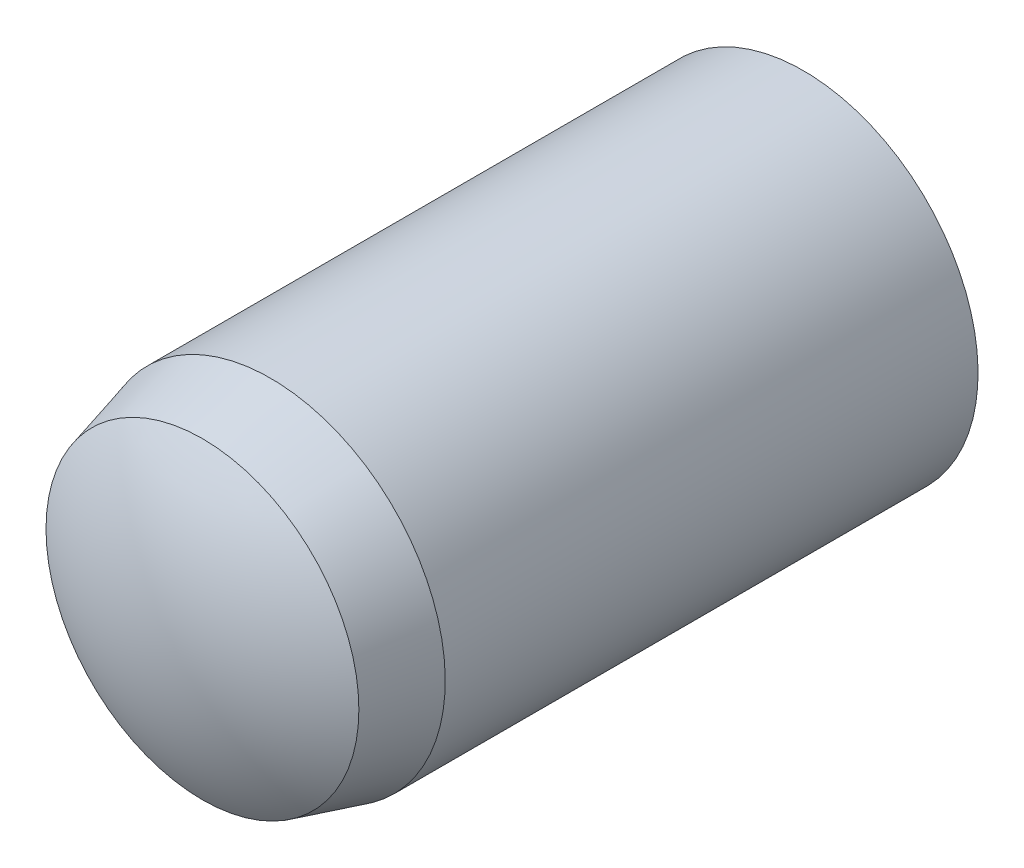
ISO-10303-21;
HEADER;
FILE_DESCRIPTION(('STEP AP214'),'2;1');
FILE_NAME('part.step','',(''),(''),'','','');
FILE_SCHEMA(('AUTOMOTIVE_DESIGN { 1 0 10303 214 1 1 1 1 }'));
ENDSEC;
DATA;
#1=APPLICATION_CONTEXT('core data for automotive mechanical design processes');
#2=APPLICATION_PROTOCOL_DEFINITION('international standard','automotive_design',2000,#1);
#3=PRODUCT_CONTEXT('',#1,'mechanical');
#4=PRODUCT('Part','Part','',(#3));
#5=PRODUCT_RELATED_PRODUCT_CATEGORY('part','',(#4));
#6=PRODUCT_DEFINITION_FORMATION('','',#4);
#7=PRODUCT_DEFINITION_CONTEXT('part definition',#1,'design');
#8=PRODUCT_DEFINITION('design','',#6,#7);
#9=PRODUCT_DEFINITION_SHAPE('','',#8);
#10=(LENGTH_UNIT() NAMED_UNIT(*) SI_UNIT(.MILLI.,.METRE.));
#11=(NAMED_UNIT(*) PLANE_ANGLE_UNIT() SI_UNIT($,.RADIAN.));
#12=(NAMED_UNIT(*) SI_UNIT($,.STERADIAN.) SOLID_ANGLE_UNIT());
#13=UNCERTAINTY_MEASURE_WITH_UNIT(LENGTH_MEASURE(1.E-05),#10,'distance_accuracy_value','');
#14=(GEOMETRIC_REPRESENTATION_CONTEXT(3) GLOBAL_UNCERTAINTY_ASSIGNED_CONTEXT((#13)) GLOBAL_UNIT_ASSIGNED_CONTEXT((#10,
#11,#12)) REPRESENTATION_CONTEXT('',''));
#15=CARTESIAN_POINT('',(0.,0.,0.));
#16=DIRECTION('',(0.,0.,1.));
#17=DIRECTION('',(1.,0.,0.));
#18=AXIS2_PLACEMENT_3D('',#15,#16,#17);
#19=CARTESIAN_POINT('',(0.,0.,-0.916666666666677));
#20=DIRECTION('',(0.,0.,1.));
#21=DIRECTION('',(0.,-1.,0.));
#22=AXIS2_PLACEMENT_3D('',#19,#20,#21);
#23=SPHERICAL_SURFACE('',#22,9.08333333333331);
#24=CARTESIAN_POINT('',(0.,0.,-8.50000000000001));
#25=DIRECTION('',(0.,0.,1.));
#26=DIRECTION('',(0.,-1.,0.));
#27=AXIS2_PLACEMENT_3D('',#24,#25,#26);
#28=CIRCLE('',#27,5.);
#29=CARTESIAN_POINT('',(0.,-5.,-8.50000000000001));
#30=VERTEX_POINT('',#29);
#31=EDGE_CURVE('E12',#30,#30,#28,.T.);
#32=ORIENTED_EDGE('',*,*,#31,.F.);
#33=EDGE_LOOP('',(#32));
#34=FACE_BOUND('',#33,.T.);
#35=ADVANCED_FACE('F45',(#34),#23,.T.);
#36=CARTESIAN_POINT('',(0.,0.,10.));
#37=DIRECTION('',(0.,0.,1.));
#38=DIRECTION('',(0.,-1.,0.));
#39=AXIS2_PLACEMENT_3D('',#36,#37,#38);
#40=CYLINDRICAL_SURFACE('',#39,5.);
#41=CARTESIAN_POINT('',(0.,0.,6.74999999999998));
#42=DIRECTION('',(0.,0.,1.));
#43=DIRECTION('',(0.,-1.,0.));
#44=AXIS2_PLACEMENT_3D('',#41,#42,#43);
#45=CIRCLE('',#44,5.);
#46=CARTESIAN_POINT('',(0.,-5.,6.74999999999998));
#47=VERTEX_POINT('',#46);
#48=EDGE_CURVE('E51',#47,#47,#45,.T.);
#49=ORIENTED_EDGE('',*,*,#48,.F.);
#50=EDGE_LOOP('',(#49));
#51=FACE_BOUND('',#50,.T.);
#52=ORIENTED_EDGE('',*,*,#31,.T.);
#53=EDGE_LOOP('',(#52));
#54=FACE_BOUND('',#53,.T.);
#55=ADVANCED_FACE('F66',(#51,#54),#40,.T.);
#56=CARTESIAN_POINT('',(0.,0.,6.74999999999998));
#57=DIRECTION('',(0.,0.,-1.));
#58=DIRECTION('',(0.,1.,0.));
#59=AXIS2_PLACEMENT_3D('',#56,#57,#58);
#60=CONICAL_SURFACE('',#59,5.,0.261799387799149);
#61=CARTESIAN_POINT('',(0.,0.,8.69999999999999));
#62=DIRECTION('',(0.,0.,1.));
#63=DIRECTION('',(0.,-1.,0.));
#64=AXIS2_PLACEMENT_3D('',#61,#62,#63);
#65=CIRCLE('',#64,4.47749907475931);
#66=CARTESIAN_POINT('',(0.,-4.47749907475931,8.69999999999999));
#67=VERTEX_POINT('',#66);
#68=EDGE_CURVE('E55',#67,#67,#65,.T.);
#69=ORIENTED_EDGE('',*,*,#68,.F.);
#70=EDGE_LOOP('',(#69));
#71=FACE_BOUND('',#70,.T.);
#72=ORIENTED_EDGE('',*,*,#48,.T.);
#73=EDGE_LOOP('',(#72));
#74=FACE_BOUND('',#73,.T.);
#75=ADVANCED_FACE('F64',(#71,#74),#60,.T.);
#76=CARTESIAN_POINT('',(0.,0.,1.63923155212675));
#77=DIRECTION('',(0.,0.,1.));
#78=DIRECTION('',(0.,1.,0.));
#79=AXIS2_PLACEMENT_3D('',#76,#77,#78);
#80=SPHERICAL_SURFACE('',#79,8.36076844787326);
#81=ORIENTED_EDGE('',*,*,#68,.T.);
#82=EDGE_LOOP('',(#81));
#83=FACE_BOUND('',#82,.T.);
#84=ADVANCED_FACE('F62',(#83),#80,.T.);
#85=CLOSED_SHELL('',(#35,#55,#75,#84));
#86=MANIFOLD_SOLID_BREP('B2',#85);
#87=ADVANCED_BREP_SHAPE_REPRESENTATION('',(#18,#86),#14);
#88=SHAPE_DEFINITION_REPRESENTATION(#9,#87);
ENDSEC;
END-ISO-10303-21;
